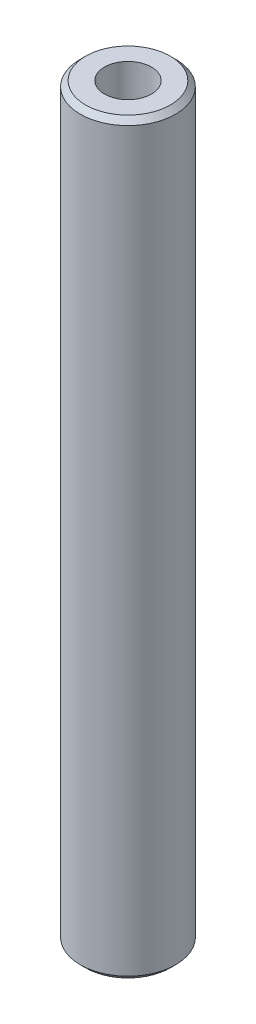
ISO-10303-21;
HEADER;
FILE_DESCRIPTION(('STEP AP214'),'2;1');
FILE_NAME('part.step','',(''),(''),'','','');
FILE_SCHEMA(('AUTOMOTIVE_DESIGN { 1 0 10303 214 1 1 1 1 }'));
ENDSEC;
DATA;
#1=APPLICATION_CONTEXT('core data for automotive mechanical design processes');
#2=APPLICATION_PROTOCOL_DEFINITION('international standard','automotive_design',2000,#1);
#3=PRODUCT_CONTEXT('',#1,'mechanical');
#4=PRODUCT('Part','Part','',(#3));
#5=PRODUCT_RELATED_PRODUCT_CATEGORY('part','',(#4));
#6=PRODUCT_DEFINITION_FORMATION('','',#4);
#7=PRODUCT_DEFINITION_CONTEXT('part definition',#1,'design');
#8=PRODUCT_DEFINITION('design','',#6,#7);
#9=PRODUCT_DEFINITION_SHAPE('','',#8);
#10=(LENGTH_UNIT() NAMED_UNIT(*) SI_UNIT(.MILLI.,.METRE.));
#11=(NAMED_UNIT(*) PLANE_ANGLE_UNIT() SI_UNIT($,.RADIAN.));
#12=(NAMED_UNIT(*) SI_UNIT($,.STERADIAN.) SOLID_ANGLE_UNIT());
#13=UNCERTAINTY_MEASURE_WITH_UNIT(LENGTH_MEASURE(1.E-05),#10,'distance_accuracy_value','');
#14=(GEOMETRIC_REPRESENTATION_CONTEXT(3) GLOBAL_UNCERTAINTY_ASSIGNED_CONTEXT((#13)) GLOBAL_UNIT_ASSIGNED_CONTEXT((#10,
#11,#12)) REPRESENTATION_CONTEXT('',''));
#15=CARTESIAN_POINT('',(0.,0.,0.));
#16=DIRECTION('',(0.,0.,1.));
#17=DIRECTION('',(1.,0.,0.));
#18=AXIS2_PLACEMENT_3D('',#15,#16,#17);
#19=CARTESIAN_POINT('',(0.,235.154857146059,0.));
#20=DIRECTION('',(0.,-1.,0.));
#21=DIRECTION('',(0.,0.,-1.));
#22=AXIS2_PLACEMENT_3D('',#19,#20,#21);
#23=CYLINDRICAL_SURFACE('',#22,15.);
#24=CARTESIAN_POINT('',(0.,233.479585032577,0.));
#25=DIRECTION('',(0.,1.,0.));
#26=DIRECTION('',(0.,0.,1.));
#27=AXIS2_PLACEMENT_3D('',#24,#25,#26);
#28=CIRCLE('',#27,15.);
#29=CARTESIAN_POINT('',(0.,233.479585032577,15.));
#30=VERTEX_POINT('',#29);
#31=EDGE_CURVE('E50',#30,#30,#28,.F.);
#32=ORIENTED_EDGE('',*,*,#31,.T.);
#33=EDGE_LOOP('',(#32));
#34=FACE_BOUND('',#33,.T.);
#35=CARTESIAN_POINT('',(0.,1.67527211348242,0.));
#36=DIRECTION('',(0.,1.,0.));
#37=DIRECTION('',(0.,0.,1.));
#38=AXIS2_PLACEMENT_3D('',#35,#36,#37);
#39=CIRCLE('',#38,15.);
#40=CARTESIAN_POINT('',(0.,1.67527211348242,15.));
#41=VERTEX_POINT('',#40);
#42=EDGE_CURVE('E51',#41,#41,#39,.T.);
#43=ORIENTED_EDGE('',*,*,#42,.T.);
#44=EDGE_LOOP('',(#43));
#45=FACE_BOUND('',#44,.T.);
#46=ADVANCED_FACE('F39',(#34,#45),#23,.T.);
#47=CARTESIAN_POINT('',(0.,235.154857146059,0.));
#48=DIRECTION('',(0.,1.,0.));
#49=DIRECTION('',(0.,0.,1.));
#50=AXIS2_PLACEMENT_3D('',#47,#48,#49);
#51=PLANE('',#50);
#52=CARTESIAN_POINT('',(0.,235.154857146059,0.));
#53=DIRECTION('',(0.,1.,0.));
#54=DIRECTION('',(0.,0.,1.));
#55=AXIS2_PLACEMENT_3D('',#52,#53,#54);
#56=CIRCLE('',#55,13.3247278865175);
#57=CARTESIAN_POINT('',(0.,235.154857146059,13.3247278865175));
#58=VERTEX_POINT('',#57);
#59=EDGE_CURVE('E54',#58,#58,#56,.T.);
#60=ORIENTED_EDGE('',*,*,#59,.T.);
#61=EDGE_LOOP('',(#60));
#62=FACE_BOUND('',#61,.T.);
#63=CARTESIAN_POINT('',(0.,235.154857146059,0.));
#64=DIRECTION('',(0.,1.,0.));
#65=DIRECTION('',(0.,0.,1.));
#66=AXIS2_PLACEMENT_3D('',#63,#64,#65);
#67=CIRCLE('',#66,7.37923606490672);
#68=CARTESIAN_POINT('',(0.,235.154857146059,7.37923606490672));
#69=VERTEX_POINT('',#68);
#70=EDGE_CURVE('E58',#69,#69,#67,.T.);
#71=ORIENTED_EDGE('',*,*,#70,.F.);
#72=EDGE_LOOP('',(#71));
#73=FACE_BOUND('',#72,.T.);
#74=ADVANCED_FACE('F69',(#62,#73),#51,.T.);
#75=CARTESIAN_POINT('',(0.,0.,0.));
#76=DIRECTION('',(0.,1.,0.));
#77=DIRECTION('',(0.,0.,1.));
#78=AXIS2_PLACEMENT_3D('',#75,#76,#77);
#79=PLANE('',#78);
#80=CARTESIAN_POINT('',(0.,0.,0.));
#81=DIRECTION('',(0.,1.,0.));
#82=DIRECTION('',(0.,0.,1.));
#83=AXIS2_PLACEMENT_3D('',#80,#81,#82);
#84=CIRCLE('',#83,13.3247278865176);
#85=CARTESIAN_POINT('',(0.,0.,13.3247278865176));
#86=VERTEX_POINT('',#85);
#87=EDGE_CURVE('E10',#86,#86,#84,.F.);
#88=ORIENTED_EDGE('',*,*,#87,.T.);
#89=EDGE_LOOP('',(#88));
#90=FACE_BOUND('',#89,.T.);
#91=CARTESIAN_POINT('',(0.,0.,0.));
#92=DIRECTION('',(0.,1.,0.));
#93=DIRECTION('',(0.,0.,1.));
#94=AXIS2_PLACEMENT_3D('',#91,#92,#93);
#95=CIRCLE('',#94,7.37923606490672);
#96=CARTESIAN_POINT('',(0.,0.,7.37923606490672));
#97=VERTEX_POINT('',#96);
#98=EDGE_CURVE('E63',#97,#97,#95,.T.);
#99=ORIENTED_EDGE('',*,*,#98,.T.);
#100=EDGE_LOOP('',(#99));
#101=FACE_BOUND('',#100,.T.);
#102=ADVANCED_FACE('F75',(#90,#101),#79,.F.);
#103=CARTESIAN_POINT('',(0.,235.154857146059,0.));
#104=DIRECTION('',(0.,-1.,0.));
#105=DIRECTION('',(0.,0.,-1.));
#106=AXIS2_PLACEMENT_3D('',#103,#104,#105);
#107=CYLINDRICAL_SURFACE('',#106,7.37923606490672);
#108=ORIENTED_EDGE('',*,*,#70,.T.);
#109=EDGE_LOOP('',(#108));
#110=FACE_BOUND('',#109,.T.);
#111=ORIENTED_EDGE('',*,*,#98,.F.);
#112=EDGE_LOOP('',(#111));
#113=FACE_BOUND('',#112,.T.);
#114=ADVANCED_FACE('F70',(#110,#113),#107,.F.);
#115=CARTESIAN_POINT('',(0.,235.154857146059,0.));
#116=DIRECTION('',(0.,-1.,0.));
#117=DIRECTION('',(0.,0.,-1.));
#118=AXIS2_PLACEMENT_3D('',#115,#116,#117);
#119=CONICAL_SURFACE('',#118,13.3247278865175,0.785398163397444);
#120=ORIENTED_EDGE('',*,*,#31,.F.);
#121=EDGE_LOOP('',(#120));
#122=FACE_BOUND('',#121,.T.);
#123=ORIENTED_EDGE('',*,*,#59,.F.);
#124=EDGE_LOOP('',(#123));
#125=FACE_BOUND('',#124,.T.);
#126=ADVANCED_FACE('F81',(#122,#125),#119,.T.);
#127=CARTESIAN_POINT('',(0.,1.67527211348242,0.));
#128=DIRECTION('',(0.,1.,0.));
#129=DIRECTION('',(0.,0.,1.));
#130=AXIS2_PLACEMENT_3D('',#127,#128,#129);
#131=CONICAL_SURFACE('',#130,15.,0.785398163397452);
#132=ORIENTED_EDGE('',*,*,#87,.F.);
#133=EDGE_LOOP('',(#132));
#134=FACE_BOUND('',#133,.T.);
#135=ORIENTED_EDGE('',*,*,#42,.F.);
#136=EDGE_LOOP('',(#135));
#137=FACE_BOUND('',#136,.T.);
#138=ADVANCED_FACE('F45',(#134,#137),#131,.T.);
#139=CLOSED_SHELL('',(#46,#74,#102,#114,#126,#138));
#140=MANIFOLD_SOLID_BREP('B2',#139);
#141=ADVANCED_BREP_SHAPE_REPRESENTATION('',(#18,#140),#14);
#142=SHAPE_DEFINITION_REPRESENTATION(#9,#141);
ENDSEC;
END-ISO-10303-21;
